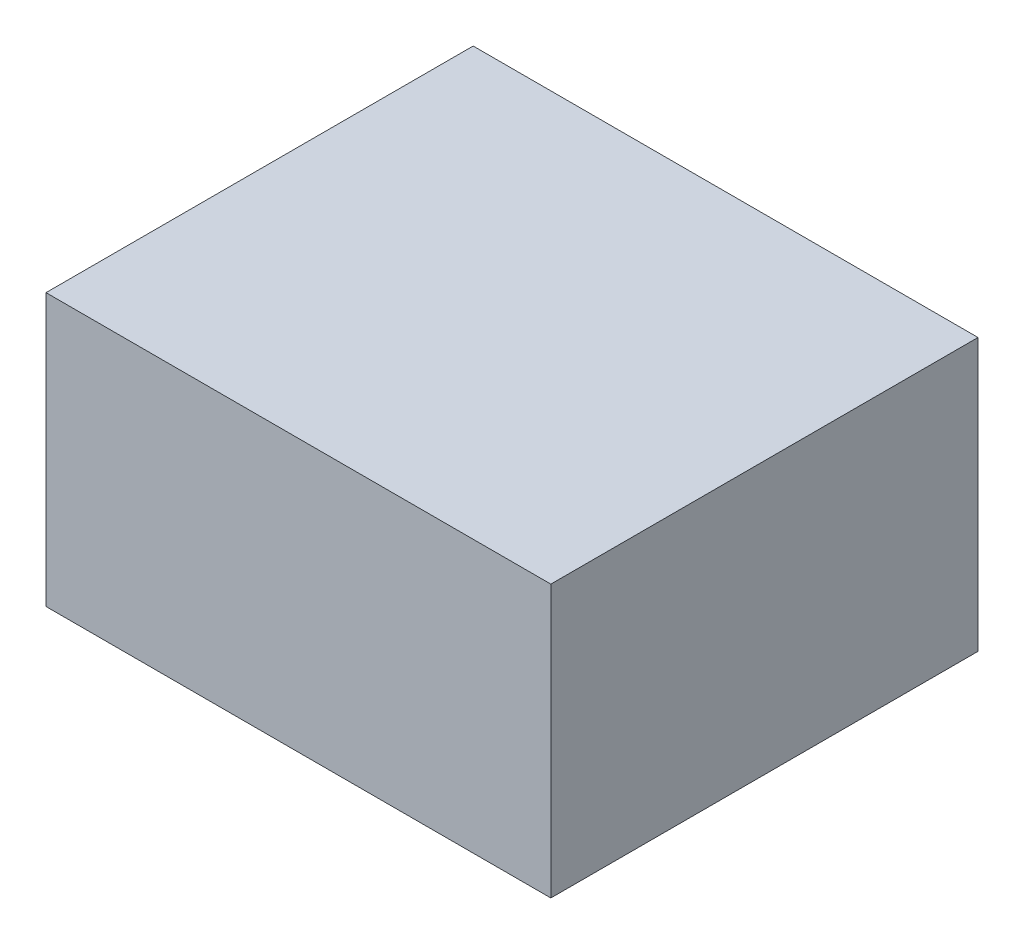
ISO-10303-21;
HEADER;
FILE_DESCRIPTION(('STEP AP214'),'2;1');
FILE_NAME('part.step','',(''),(''),'','','');
FILE_SCHEMA(('AUTOMOTIVE_DESIGN { 1 0 10303 214 1 1 1 1 }'));
ENDSEC;
DATA;
#1=APPLICATION_CONTEXT('core data for automotive mechanical design processes');
#2=APPLICATION_PROTOCOL_DEFINITION('international standard','automotive_design',2000,#1);
#3=PRODUCT_CONTEXT('',#1,'mechanical');
#4=PRODUCT('Part','Part','',(#3));
#5=PRODUCT_RELATED_PRODUCT_CATEGORY('part','',(#4));
#6=PRODUCT_DEFINITION_FORMATION('','',#4);
#7=PRODUCT_DEFINITION_CONTEXT('part definition',#1,'design');
#8=PRODUCT_DEFINITION('design','',#6,#7);
#9=PRODUCT_DEFINITION_SHAPE('','',#8);
#10=(LENGTH_UNIT() NAMED_UNIT(*) SI_UNIT(.MILLI.,.METRE.));
#11=(NAMED_UNIT(*) PLANE_ANGLE_UNIT() SI_UNIT($,.RADIAN.));
#12=(NAMED_UNIT(*) SI_UNIT($,.STERADIAN.) SOLID_ANGLE_UNIT());
#13=UNCERTAINTY_MEASURE_WITH_UNIT(LENGTH_MEASURE(1.E-05),#10,'distance_accuracy_value','');
#14=(GEOMETRIC_REPRESENTATION_CONTEXT(3) GLOBAL_UNCERTAINTY_ASSIGNED_CONTEXT((#13)) GLOBAL_UNIT_ASSIGNED_CONTEXT((#10,
#11,#12)) REPRESENTATION_CONTEXT('',''));
#15=CARTESIAN_POINT('',(0.,0.,0.));
#16=DIRECTION('',(0.,0.,1.));
#17=DIRECTION('',(1.,0.,0.));
#18=AXIS2_PLACEMENT_3D('',#15,#16,#17);
#19=CARTESIAN_POINT('',(0.32500062,0.17500092,0.));
#20=DIRECTION('',(0.,-1.,0.));
#21=DIRECTION('',(0.,0.,-1.));
#22=AXIS2_PLACEMENT_3D('',#19,#20,#21);
#23=PLANE('',#22);
#24=DIRECTION('',(0.,0.,-1.));
#25=VECTOR('',#24,1.);
#26=CARTESIAN_POINT('',(-0.32500062,0.17500092,0.));
#27=LINE('',#26,#25);
#28=CARTESIAN_POINT('',(-0.32500062,0.17500092,0.));
#29=VERTEX_POINT('',#28);
#30=CARTESIAN_POINT('',(-0.32500062,0.17500092,0.5499989));
#31=VERTEX_POINT('',#30);
#32=EDGE_CURVE('E20',#29,#31,#27,.F.);
#33=ORIENTED_EDGE('',*,*,#32,.T.);
#34=DIRECTION('',(-1.,0.,0.));
#35=VECTOR('',#34,1.);
#36=CARTESIAN_POINT('',(-0.32500062,0.17500092,0.5499989));
#37=LINE('',#36,#35);
#38=CARTESIAN_POINT('',(0.32500062,0.17500092,0.5499989));
#39=VERTEX_POINT('',#38);
#40=EDGE_CURVE('E55',#31,#39,#37,.F.);
#41=ORIENTED_EDGE('',*,*,#40,.T.);
#42=DIRECTION('',(0.,0.,1.));
#43=VECTOR('',#42,1.);
#44=CARTESIAN_POINT('',(0.32500062,0.17500092,0.));
#45=LINE('',#44,#43);
#46=CARTESIAN_POINT('',(0.32500062,0.17500092,0.));
#47=VERTEX_POINT('',#46);
#48=EDGE_CURVE('E76',#39,#47,#45,.F.);
#49=ORIENTED_EDGE('',*,*,#48,.T.);
#50=DIRECTION('',(-1.,0.,0.));
#51=VECTOR('',#50,1.);
#52=CARTESIAN_POINT('',(-0.32500062,0.17500092,0.));
#53=LINE('',#52,#51);
#54=EDGE_CURVE('E58',#29,#47,#53,.F.);
#55=ORIENTED_EDGE('',*,*,#54,.F.);
#56=EDGE_LOOP('',(#33,#41,#49,#55));
#57=FACE_BOUND('',#56,.T.);
#58=ADVANCED_FACE('F17',(#57),#23,.F.);
#59=CARTESIAN_POINT('',(-0.32500062,0.17500092,0.));
#60=DIRECTION('',(1.,0.,0.));
#61=DIRECTION('',(0.,0.,-1.));
#62=AXIS2_PLACEMENT_3D('',#59,#60,#61);
#63=PLANE('',#62);
#64=DIRECTION('',(0.,0.,1.));
#65=VECTOR('',#64,1.);
#66=CARTESIAN_POINT('',(-0.32500062,-0.17500092,0.));
#67=LINE('',#66,#65);
#68=CARTESIAN_POINT('',(-0.32500062,-0.17500092,0.));
#69=VERTEX_POINT('',#68);
#70=CARTESIAN_POINT('',(-0.32500062,-0.17500092,0.5499989));
#71=VERTEX_POINT('',#70);
#72=EDGE_CURVE('E73',#69,#71,#67,.T.);
#73=ORIENTED_EDGE('',*,*,#72,.T.);
#74=DIRECTION('',(0.,1.,0.));
#75=VECTOR('',#74,1.);
#76=CARTESIAN_POINT('',(-0.32500062,-0.17500092,0.5499989));
#77=LINE('',#76,#75);
#78=EDGE_CURVE('E63',#71,#31,#77,.T.);
#79=ORIENTED_EDGE('',*,*,#78,.T.);
#80=ORIENTED_EDGE('',*,*,#32,.F.);
#81=DIRECTION('',(0.,1.,0.));
#82=VECTOR('',#81,1.);
#83=CARTESIAN_POINT('',(-0.32500062,-0.17500092,0.));
#84=LINE('',#83,#82);
#85=EDGE_CURVE('E78',#69,#29,#84,.T.);
#86=ORIENTED_EDGE('',*,*,#85,.F.);
#87=EDGE_LOOP('',(#73,#79,#80,#86));
#88=FACE_BOUND('',#87,.T.);
#89=ADVANCED_FACE('F72',(#88),#63,.F.);
#90=CARTESIAN_POINT('',(-0.32500062,-0.17500092,0.5499989));
#91=DIRECTION('',(0.,0.,-1.));
#92=DIRECTION('',(-1.,0.,0.));
#93=AXIS2_PLACEMENT_3D('',#90,#91,#92);
#94=PLANE('',#93);
#95=DIRECTION('',(0.,1.,0.));
#96=VECTOR('',#95,1.);
#97=CARTESIAN_POINT('',(0.32500062,-0.17500092,0.5499989));
#98=LINE('',#97,#96);
#99=CARTESIAN_POINT('',(0.32500062,-0.17500092,0.5499989));
#100=VERTEX_POINT('',#99);
#101=EDGE_CURVE('E69',#100,#39,#98,.T.);
#102=ORIENTED_EDGE('',*,*,#101,.T.);
#103=ORIENTED_EDGE('',*,*,#40,.F.);
#104=ORIENTED_EDGE('',*,*,#78,.F.);
#105=DIRECTION('',(1.,0.,0.));
#106=VECTOR('',#105,1.);
#107=CARTESIAN_POINT('',(-0.32500062,-0.17500092,0.5499989));
#108=LINE('',#107,#106);
#109=EDGE_CURVE('E83',#71,#100,#108,.T.);
#110=ORIENTED_EDGE('',*,*,#109,.T.);
#111=EDGE_LOOP('',(#102,#103,#104,#110));
#112=FACE_BOUND('',#111,.T.);
#113=ADVANCED_FACE('F66',(#112),#94,.F.);
#114=CARTESIAN_POINT('',(0.32500062,-0.17500092,0.));
#115=DIRECTION('',(-1.,0.,0.));
#116=DIRECTION('',(0.,0.,1.));
#117=AXIS2_PLACEMENT_3D('',#114,#115,#116);
#118=PLANE('',#117);
#119=ORIENTED_EDGE('',*,*,#48,.F.);
#120=ORIENTED_EDGE('',*,*,#101,.F.);
#121=DIRECTION('',(0.,0.,1.));
#122=VECTOR('',#121,1.);
#123=CARTESIAN_POINT('',(0.32500062,-0.17500092,0.));
#124=LINE('',#123,#122);
#125=CARTESIAN_POINT('',(0.32500062,-0.17500092,0.));
#126=VERTEX_POINT('',#125);
#127=EDGE_CURVE('E26',#100,#126,#124,.F.);
#128=ORIENTED_EDGE('',*,*,#127,.T.);
#129=DIRECTION('',(0.,1.,0.));
#130=VECTOR('',#129,1.);
#131=CARTESIAN_POINT('',(0.32500062,-0.17500092,0.));
#132=LINE('',#131,#130);
#133=EDGE_CURVE('E34',#47,#126,#132,.F.);
#134=ORIENTED_EDGE('',*,*,#133,.F.);
#135=EDGE_LOOP('',(#119,#120,#128,#134));
#136=FACE_BOUND('',#135,.T.);
#137=ADVANCED_FACE('F88',(#136),#118,.F.);
#138=CARTESIAN_POINT('',(-0.32500062,-0.17500092,0.));
#139=DIRECTION('',(0.,0.,-1.));
#140=DIRECTION('',(-1.,0.,0.));
#141=AXIS2_PLACEMENT_3D('',#138,#139,#140);
#142=PLANE('',#141);
#143=ORIENTED_EDGE('',*,*,#133,.T.);
#144=DIRECTION('',(1.,0.,0.));
#145=VECTOR('',#144,1.);
#146=CARTESIAN_POINT('',(-0.32500062,-0.17500092,0.));
#147=LINE('',#146,#145);
#148=EDGE_CURVE('E11',#126,#69,#147,.F.);
#149=ORIENTED_EDGE('',*,*,#148,.T.);
#150=ORIENTED_EDGE('',*,*,#85,.T.);
#151=ORIENTED_EDGE('',*,*,#54,.T.);
#152=EDGE_LOOP('',(#143,#149,#150,#151));
#153=FACE_BOUND('',#152,.T.);
#154=ADVANCED_FACE('F91',(#153),#142,.T.);
#155=CARTESIAN_POINT('',(-0.32500062,-0.17500092,0.));
#156=DIRECTION('',(0.,1.,0.));
#157=DIRECTION('',(0.,0.,1.));
#158=AXIS2_PLACEMENT_3D('',#155,#156,#157);
#159=PLANE('',#158);
#160=ORIENTED_EDGE('',*,*,#127,.F.);
#161=ORIENTED_EDGE('',*,*,#109,.F.);
#162=ORIENTED_EDGE('',*,*,#72,.F.);
#163=ORIENTED_EDGE('',*,*,#148,.F.);
#164=EDGE_LOOP('',(#160,#161,#162,#163));
#165=FACE_BOUND('',#164,.T.);
#166=ADVANCED_FACE('F90',(#165),#159,.F.);
#167=CLOSED_SHELL('',(#58,#89,#113,#137,#154,#166));
#168=MANIFOLD_SOLID_BREP('B1',#167);
#169=ADVANCED_BREP_SHAPE_REPRESENTATION('',(#18,#168),#14);
#170=SHAPE_DEFINITION_REPRESENTATION(#9,#169);
ENDSEC;
END-ISO-10303-21;
